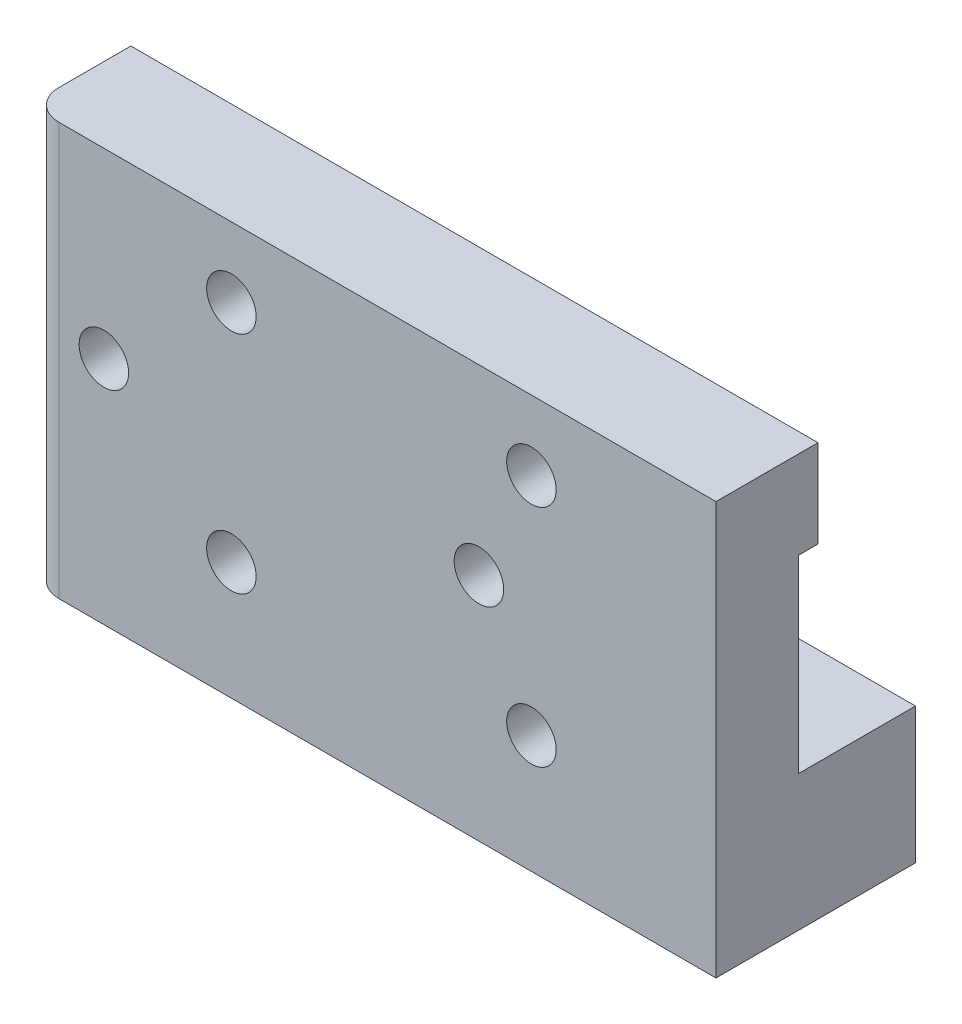
ISO-10303-21;
HEADER;
FILE_DESCRIPTION(('STEP AP214'),'2;1');
FILE_NAME('part.step','',(''),(''),'','','');
FILE_SCHEMA(('AUTOMOTIVE_DESIGN { 1 0 10303 214 1 1 1 1 }'));
ENDSEC;
DATA;
#1=APPLICATION_CONTEXT('core data for automotive mechanical design processes');
#2=APPLICATION_PROTOCOL_DEFINITION('international standard','automotive_design',2000,#1);
#3=PRODUCT_CONTEXT('',#1,'mechanical');
#4=PRODUCT('Part','Part','',(#3));
#5=PRODUCT_RELATED_PRODUCT_CATEGORY('part','',(#4));
#6=PRODUCT_DEFINITION_FORMATION('','',#4);
#7=PRODUCT_DEFINITION_CONTEXT('part definition',#1,'design');
#8=PRODUCT_DEFINITION('design','',#6,#7);
#9=PRODUCT_DEFINITION_SHAPE('','',#8);
#10=(LENGTH_UNIT() NAMED_UNIT(*) SI_UNIT(.MILLI.,.METRE.));
#11=(NAMED_UNIT(*) PLANE_ANGLE_UNIT() SI_UNIT($,.RADIAN.));
#12=(NAMED_UNIT(*) SI_UNIT($,.STERADIAN.) SOLID_ANGLE_UNIT());
#13=UNCERTAINTY_MEASURE_WITH_UNIT(LENGTH_MEASURE(1.E-05),#10,'distance_accuracy_value','');
#14=(GEOMETRIC_REPRESENTATION_CONTEXT(3) GLOBAL_UNCERTAINTY_ASSIGNED_CONTEXT((#13)) GLOBAL_UNIT_ASSIGNED_CONTEXT((#10,
#11,#12)) REPRESENTATION_CONTEXT('',''));
#15=CARTESIAN_POINT('',(0.,0.,0.));
#16=DIRECTION('',(0.,0.,1.));
#17=DIRECTION('',(1.,0.,0.));
#18=AXIS2_PLACEMENT_3D('',#15,#16,#17);
#19=CARTESIAN_POINT('',(0.,0.,1.4));
#20=DIRECTION('',(0.,0.,-1.));
#21=DIRECTION('',(-1.,0.,0.));
#22=AXIS2_PLACEMENT_3D('',#19,#20,#21);
#23=PLANE('',#22);
#24=CARTESIAN_POINT('',(-29.6500000000076,-15.3500000000019,1.4));
#25=DIRECTION('',(0.,0.,1.));
#26=DIRECTION('',(1.,0.,0.));
#27=AXIS2_PLACEMENT_3D('',#24,#25,#26);
#28=CIRCLE('',#27,1.65000000000119);
#29=CARTESIAN_POINT('',(-28.0000000000064,-15.3500000000019,1.4));
#30=VERTEX_POINT('',#29);
#31=EDGE_CURVE('E312',#30,#30,#28,.T.);
#32=ORIENTED_EDGE('',*,*,#31,.T.);
#33=EDGE_LOOP('',(#32));
#34=FACE_BOUND('',#33,.T.);
#35=CARTESIAN_POINT('',(-54.6500000000076,-15.3500000000021,1.4));
#36=DIRECTION('',(0.,0.,1.));
#37=DIRECTION('',(1.,0.,0.));
#38=AXIS2_PLACEMENT_3D('',#35,#36,#37);
#39=CIRCLE('',#38,1.65000000000119);
#40=CARTESIAN_POINT('',(-53.0000000000064,-15.3500000000021,1.4));
#41=VERTEX_POINT('',#40);
#42=EDGE_CURVE('E273',#41,#41,#39,.T.);
#43=ORIENTED_EDGE('',*,*,#42,.T.);
#44=EDGE_LOOP('',(#43));
#45=FACE_BOUND('',#44,.T.);
#46=DIRECTION('',(0.,1.,0.));
#47=VECTOR('',#46,1.);
#48=CARTESIAN_POINT('',(-13.8500000000063,0.,1.4));
#49=LINE('',#48,#47);
#50=CARTESIAN_POINT('',(-13.8500000000063,-21.6499999999996,1.4));
#51=VERTEX_POINT('',#50);
#52=CARTESIAN_POINT('',(-13.8500000000063,-9.04999999999959,1.4));
#53=VERTEX_POINT('',#52);
#54=EDGE_CURVE('E262',#51,#53,#49,.T.);
#55=ORIENTED_EDGE('',*,*,#54,.F.);
#56=DIRECTION('',(1.,0.,0.));
#57=VECTOR('',#56,1.);
#58=CARTESIAN_POINT('',(0.,-21.6499999999996,1.4));
#59=LINE('',#58,#57);
#60=CARTESIAN_POINT('',(-25.0175104948905,-21.6499999999996,1.4));
#61=VERTEX_POINT('',#60);
#62=EDGE_CURVE('E260',#61,#51,#59,.T.);
#63=ORIENTED_EDGE('',*,*,#62,.F.);
#64=CARTESIAN_POINT('',(-26.1500000000038,-22.8499864669215,1.4));
#65=DIRECTION('',(0.,0.,1.));
#66=DIRECTION('',(1.,0.,0.));
#67=AXIS2_PLACEMENT_3D('',#64,#65,#66);
#68=CIRCLE('',#67,1.64999999999618);
#69=CARTESIAN_POINT('',(-27.2824895051171,-21.6499999999996,1.4));
#70=VERTEX_POINT('',#69);
#71=EDGE_CURVE('E246',#61,#70,#68,.T.);
#72=ORIENTED_EDGE('',*,*,#71,.T.);
#73=CARTESIAN_POINT('',(-45.0175104948895,-21.6499999999996,1.4));
#74=VERTEX_POINT('',#73);
#75=EDGE_CURVE('E269',#74,#70,#59,.T.);
#76=ORIENTED_EDGE('',*,*,#75,.F.);
#77=CARTESIAN_POINT('',(-46.1500000000064,-22.8499864669215,1.4));
#78=DIRECTION('',(0.,0.,1.));
#79=DIRECTION('',(1.,0.,0.));
#80=AXIS2_PLACEMENT_3D('',#77,#78,#79);
#81=CIRCLE('',#80,1.64999999999864);
#82=CARTESIAN_POINT('',(-47.2824895051233,-21.6499999999996,1.4));
#83=VERTEX_POINT('',#82);
#84=EDGE_CURVE('E301',#74,#83,#81,.T.);
#85=ORIENTED_EDGE('',*,*,#84,.T.);
#86=CARTESIAN_POINT('',(-59.6500000000061,-21.6499999999996,1.4));
#87=VERTEX_POINT('',#86);
#88=EDGE_CURVE('E267',#87,#83,#59,.T.);
#89=ORIENTED_EDGE('',*,*,#88,.F.);
#90=DIRECTION('',(0.,1.,0.));
#91=VECTOR('',#90,1.);
#92=CARTESIAN_POINT('',(-59.6500000000061,0.,1.4));
#93=LINE('',#92,#91);
#94=CARTESIAN_POINT('',(-59.6500000000061,-9.04999999999959,1.4));
#95=VERTEX_POINT('',#94);
#96=EDGE_CURVE('E318',#87,#95,#93,.T.);
#97=ORIENTED_EDGE('',*,*,#96,.T.);
#98=DIRECTION('',(1.,0.,0.));
#99=VECTOR('',#98,1.);
#100=CARTESIAN_POINT('',(0.,-9.04999999999959,1.4));
#101=LINE('',#100,#99);
#102=CARTESIAN_POINT('',(-47.2824751652994,-9.04999999999959,1.4));
#103=VERTEX_POINT('',#102);
#104=EDGE_CURVE('E337',#95,#103,#101,.T.);
#105=ORIENTED_EDGE('',*,*,#104,.T.);
#106=CARTESIAN_POINT('',(-46.1500000000064,-7.8500000000028,1.4));
#107=DIRECTION('',(0.,0.,1.));
#108=DIRECTION('',(1.,0.,0.));
#109=AXIS2_PLACEMENT_3D('',#106,#107,#108);
#110=CIRCLE('',#109,1.64999999999931);
#111=CARTESIAN_POINT('',(-45.0175248347134,-9.04999999999959,1.4));
#112=VERTEX_POINT('',#111);
#113=EDGE_CURVE('E307',#103,#112,#110,.T.);
#114=ORIENTED_EDGE('',*,*,#113,.T.);
#115=CARTESIAN_POINT('',(-27.2824751652994,-9.04999999999959,1.4));
#116=VERTEX_POINT('',#115);
#117=EDGE_CURVE('E339',#112,#116,#101,.T.);
#118=ORIENTED_EDGE('',*,*,#117,.T.);
#119=CARTESIAN_POINT('',(-26.1500000000064,-7.85000000000278,1.4));
#120=DIRECTION('',(0.,0.,1.));
#121=DIRECTION('',(1.,0.,0.));
#122=AXIS2_PLACEMENT_3D('',#119,#120,#121);
#123=CIRCLE('',#122,1.64999999999932);
#124=CARTESIAN_POINT('',(-25.0175248347134,-9.04999999999959,1.4));
#125=VERTEX_POINT('',#124);
#126=EDGE_CURVE('E296',#116,#125,#123,.T.);
#127=ORIENTED_EDGE('',*,*,#126,.T.);
#128=EDGE_CURVE('E335',#125,#53,#101,.T.);
#129=ORIENTED_EDGE('',*,*,#128,.T.);
#130=EDGE_LOOP('',(#55,#63,#72,#76,#85,#89,#97,#105,#114,#118,#127,#129));
#131=FACE_BOUND('',#130,.T.);
#132=ADVANCED_FACE('F127',(#34,#45,#131),#23,.T.);
#133=CARTESIAN_POINT('',(-26.1500000000064,-7.85000000000278,1.4));
#134=DIRECTION('',(0.,0.,-1.));
#135=DIRECTION('',(-1.,0.,0.));
#136=AXIS2_PLACEMENT_3D('',#133,#134,#135);
#137=CYLINDRICAL_SURFACE('',#136,1.64999999999932);
#138=CARTESIAN_POINT('',(-26.1500000000064,-7.85000000000278,0.1));
#139=DIRECTION('',(0.,0.,1.));
#140=DIRECTION('',(1.,0.,0.));
#141=AXIS2_PLACEMENT_3D('',#138,#139,#140);
#142=CIRCLE('',#141,1.64999999999932);
#143=CARTESIAN_POINT('',(-25.0175248347134,-9.04999999999959,0.1));
#144=VERTEX_POINT('',#143);
#145=CARTESIAN_POINT('',(-27.2824751652994,-9.04999999999959,0.1));
#146=VERTEX_POINT('',#145);
#147=EDGE_CURVE('E334',#144,#146,#142,.T.);
#148=ORIENTED_EDGE('',*,*,#147,.F.);
#149=DIRECTION('',(0.,0.,-1.));
#150=VECTOR('',#149,1.);
#151=CARTESIAN_POINT('',(-25.0175248347134,-9.04999999999959,1.4));
#152=LINE('',#151,#150);
#153=EDGE_CURVE('E372',#125,#144,#152,.T.);
#154=ORIENTED_EDGE('',*,*,#153,.F.);
#155=ORIENTED_EDGE('',*,*,#126,.F.);
#156=DIRECTION('',(0.,0.,-1.));
#157=VECTOR('',#156,1.);
#158=CARTESIAN_POINT('',(-27.2824751652994,-9.04999999999959,1.4));
#159=LINE('',#158,#157);
#160=EDGE_CURVE('E357',#116,#146,#159,.T.);
#161=ORIENTED_EDGE('',*,*,#160,.T.);
#162=EDGE_LOOP('',(#148,#154,#155,#161));
#163=FACE_BOUND('',#162,.T.);
#164=CARTESIAN_POINT('',(-26.1500000000064,-7.85000000000278,6.9));
#165=DIRECTION('',(0.,0.,1.));
#166=DIRECTION('',(1.,0.,0.));
#167=AXIS2_PLACEMENT_3D('',#164,#165,#166);
#168=CIRCLE('',#167,1.64999999999932);
#169=CARTESIAN_POINT('',(-24.500000000007,-7.85000000000278,6.9));
#170=VERTEX_POINT('',#169);
#171=EDGE_CURVE('E298',#170,#170,#168,.T.);
#172=ORIENTED_EDGE('',*,*,#171,.T.);
#173=EDGE_LOOP('',(#172));
#174=FACE_BOUND('',#173,.T.);
#175=ADVANCED_FACE('F406',(#163,#174),#137,.F.);
#176=CARTESIAN_POINT('',(0.,-9.04999999999959,1.4));
#177=DIRECTION('',(0.,1.,0.));
#178=DIRECTION('',(0.,0.,1.));
#179=AXIS2_PLACEMENT_3D('',#176,#177,#178);
#180=PLANE('',#179);
#181=DIRECTION('',(1.,0.,0.));
#182=VECTOR('',#181,1.);
#183=CARTESIAN_POINT('',(0.,-9.04999999999959,0.1));
#184=LINE('',#183,#182);
#185=CARTESIAN_POINT('',(-13.8500000000063,-9.04999999999959,0.1));
#186=VERTEX_POINT('',#185);
#187=EDGE_CURVE('E342',#144,#186,#184,.T.);
#188=ORIENTED_EDGE('',*,*,#187,.T.);
#189=DIRECTION('',(0.,0.,-1.));
#190=VECTOR('',#189,1.);
#191=CARTESIAN_POINT('',(-13.8500000000063,-9.04999999999959,1.4));
#192=LINE('',#191,#190);
#193=EDGE_CURVE('E370',#53,#186,#192,.T.);
#194=ORIENTED_EDGE('',*,*,#193,.F.);
#195=ORIENTED_EDGE('',*,*,#128,.F.);
#196=ORIENTED_EDGE('',*,*,#153,.T.);
#197=EDGE_LOOP('',(#188,#194,#195,#196));
#198=FACE_BOUND('',#197,.T.);
#199=ADVANCED_FACE('F412',(#198),#180,.F.);
#200=CARTESIAN_POINT('',(-13.8500000000063,0.,1.4));
#201=DIRECTION('',(1.,0.,0.));
#202=DIRECTION('',(0.,1.,0.));
#203=AXIS2_PLACEMENT_3D('',#200,#201,#202);
#204=PLANE('',#203);
#205=DIRECTION('',(0.,-1.,0.));
#206=VECTOR('',#205,1.);
#207=CARTESIAN_POINT('',(-13.8500000000063,0.,0.1));
#208=LINE('',#207,#206);
#209=CARTESIAN_POINT('',(-13.8500000000063,-3.20000000000454,0.1));
#210=VERTEX_POINT('',#209);
#211=EDGE_CURVE('E345',#210,#186,#208,.T.);
#212=ORIENTED_EDGE('',*,*,#211,.F.);
#213=DIRECTION('',(0.,0.,-1.));
#214=VECTOR('',#213,1.);
#215=CARTESIAN_POINT('',(-13.8500000000063,-3.20000000000454,1.4));
#216=LINE('',#215,#214);
#217=CARTESIAN_POINT('',(-13.8500000000063,-3.20000000000454,6.9));
#218=VERTEX_POINT('',#217);
#219=EDGE_CURVE('E368',#218,#210,#216,.T.);
#220=ORIENTED_EDGE('',*,*,#219,.F.);
#221=DIRECTION('',(0.,1.,0.));
#222=VECTOR('',#221,1.);
#223=CARTESIAN_POINT('',(-13.8500000000063,0.,6.9));
#224=LINE('',#223,#222);
#225=CARTESIAN_POINT('',(-13.8500000000063,-30.7000000000052,6.9));
#226=VERTEX_POINT('',#225);
#227=EDGE_CURVE('E325',#226,#218,#224,.T.);
#228=ORIENTED_EDGE('',*,*,#227,.F.);
#229=DIRECTION('',(0.,0.,-1.));
#230=VECTOR('',#229,1.);
#231=CARTESIAN_POINT('',(-13.8500000000063,-30.7000000000052,6.9));
#232=LINE('',#231,#230);
#233=CARTESIAN_POINT('',(-13.8500000000063,-30.7000000000052,-6.4));
#234=VERTEX_POINT('',#233);
#235=EDGE_CURVE('E328',#226,#234,#232,.T.);
#236=ORIENTED_EDGE('',*,*,#235,.T.);
#237=DIRECTION('',(0.,1.,0.));
#238=VECTOR('',#237,1.);
#239=CARTESIAN_POINT('',(-13.8500000000063,0.,-6.4));
#240=LINE('',#239,#238);
#241=CARTESIAN_POINT('',(-13.8500000000063,-21.6499999999996,-6.4));
#242=VERTEX_POINT('',#241);
#243=EDGE_CURVE('E281',#234,#242,#240,.T.);
#244=ORIENTED_EDGE('',*,*,#243,.T.);
#245=DIRECTION('',(0.,0.,1.));
#246=VECTOR('',#245,1.);
#247=CARTESIAN_POINT('',(-13.8500000000063,-21.6499999999996,-6.4));
#248=LINE('',#247,#246);
#249=EDGE_CURVE('E274',#242,#51,#248,.T.);
#250=ORIENTED_EDGE('',*,*,#249,.T.);
#251=ORIENTED_EDGE('',*,*,#54,.T.);
#252=ORIENTED_EDGE('',*,*,#193,.T.);
#253=EDGE_LOOP('',(#212,#220,#228,#236,#244,#250,#251,#252));
#254=FACE_BOUND('',#253,.T.);
#255=ADVANCED_FACE('F414',(#254),#204,.T.);
#256=CARTESIAN_POINT('',(0.,-3.20000000000454,1.4));
#257=DIRECTION('',(0.,1.,0.));
#258=DIRECTION('',(0.,0.,1.));
#259=AXIS2_PLACEMENT_3D('',#256,#257,#258);
#260=PLANE('',#259);
#261=DIRECTION('',(0.,0.,-1.));
#262=VECTOR('',#261,1.);
#263=CARTESIAN_POINT('',(-59.6500000000061,-3.20000000000454,1.4));
#264=LINE('',#263,#262);
#265=CARTESIAN_POINT('',(-59.6500000000061,-3.20000000000454,4.9));
#266=VERTEX_POINT('',#265);
#267=CARTESIAN_POINT('',(-59.6500000000061,-3.20000000000454,0.1));
#268=VERTEX_POINT('',#267);
#269=EDGE_CURVE('E366',#266,#268,#264,.T.);
#270=ORIENTED_EDGE('',*,*,#269,.F.);
#271=CARTESIAN_POINT('',(-57.6500000000061,-3.20000000000454,4.9));
#272=DIRECTION('',(0.,1.,0.));
#273=DIRECTION('',(0.,0.,1.));
#274=AXIS2_PLACEMENT_3D('',#271,#272,#273);
#275=CIRCLE('',#274,2.);
#276=CARTESIAN_POINT('',(-57.6500000000061,-3.20000000000454,6.9));
#277=VERTEX_POINT('',#276);
#278=EDGE_CURVE('E149',#266,#277,#275,.T.);
#279=ORIENTED_EDGE('',*,*,#278,.T.);
#280=DIRECTION('',(-1.,0.,0.));
#281=VECTOR('',#280,1.);
#282=CARTESIAN_POINT('',(0.,-3.20000000000454,6.9));
#283=LINE('',#282,#281);
#284=EDGE_CURVE('E321',#218,#277,#283,.T.);
#285=ORIENTED_EDGE('',*,*,#284,.F.);
#286=ORIENTED_EDGE('',*,*,#219,.T.);
#287=DIRECTION('',(1.,0.,0.));
#288=VECTOR('',#287,1.);
#289=CARTESIAN_POINT('',(0.,-3.20000000000454,0.1));
#290=LINE('',#289,#288);
#291=EDGE_CURVE('E349',#268,#210,#290,.T.);
#292=ORIENTED_EDGE('',*,*,#291,.F.);
#293=EDGE_LOOP('',(#270,#279,#285,#286,#292));
#294=FACE_BOUND('',#293,.T.);
#295=ADVANCED_FACE('F386',(#294),#260,.T.);
#296=CARTESIAN_POINT('',(-59.6500000000061,0.,1.4));
#297=DIRECTION('',(1.,0.,0.));
#298=DIRECTION('',(0.,0.,-1.));
#299=AXIS2_PLACEMENT_3D('',#296,#297,#298);
#300=PLANE('',#299);
#301=DIRECTION('',(0.,0.,-1.));
#302=VECTOR('',#301,1.);
#303=CARTESIAN_POINT('',(-59.6500000000061,-30.7000000000052,6.9));
#304=LINE('',#303,#302);
#305=CARTESIAN_POINT('',(-59.6500000000061,-30.7000000000052,4.9));
#306=VERTEX_POINT('',#305);
#307=CARTESIAN_POINT('',(-59.6500000000062,-30.7000000000052,-6.4));
#308=VERTEX_POINT('',#307);
#309=EDGE_CURVE('E332',#306,#308,#304,.T.);
#310=ORIENTED_EDGE('',*,*,#309,.F.);
#311=DIRECTION('',(0.,1.,0.));
#312=VECTOR('',#311,1.);
#313=CARTESIAN_POINT('',(-59.6500000000061,0.,4.9));
#314=LINE('',#313,#312);
#315=EDGE_CURVE('E374',#306,#266,#314,.T.);
#316=ORIENTED_EDGE('',*,*,#315,.T.);
#317=ORIENTED_EDGE('',*,*,#269,.T.);
#318=DIRECTION('',(0.,-1.,0.));
#319=VECTOR('',#318,1.);
#320=CARTESIAN_POINT('',(-59.6500000000061,0.,0.1));
#321=LINE('',#320,#319);
#322=CARTESIAN_POINT('',(-59.6500000000061,-9.04999999999959,0.1));
#323=VERTEX_POINT('',#322);
#324=EDGE_CURVE('E352',#268,#323,#321,.T.);
#325=ORIENTED_EDGE('',*,*,#324,.T.);
#326=DIRECTION('',(0.,0.,-1.));
#327=VECTOR('',#326,1.);
#328=CARTESIAN_POINT('',(-59.6500000000061,-9.04999999999959,1.4));
#329=LINE('',#328,#327);
#330=EDGE_CURVE('E363',#95,#323,#329,.T.);
#331=ORIENTED_EDGE('',*,*,#330,.F.);
#332=ORIENTED_EDGE('',*,*,#96,.F.);
#333=DIRECTION('',(0.,0.,1.));
#334=VECTOR('',#333,1.);
#335=CARTESIAN_POINT('',(-59.6500000000061,-21.6499999999996,-6.4));
#336=LINE('',#335,#334);
#337=CARTESIAN_POINT('',(-59.6500000000061,-21.6499999999996,-6.4));
#338=VERTEX_POINT('',#337);
#339=EDGE_CURVE('E278',#338,#87,#336,.T.);
#340=ORIENTED_EDGE('',*,*,#339,.F.);
#341=DIRECTION('',(0.,1.,0.));
#342=VECTOR('',#341,1.);
#343=CARTESIAN_POINT('',(-59.650000000006,3.65882891816885E-13,-6.4));
#344=LINE('',#343,#342);
#345=EDGE_CURVE('E425',#308,#338,#344,.T.);
#346=ORIENTED_EDGE('',*,*,#345,.F.);
#347=EDGE_LOOP('',(#310,#316,#317,#325,#331,#332,#340,#346));
#348=FACE_BOUND('',#347,.T.);
#349=ADVANCED_FACE('F380',(#348),#300,.F.);
#350=CARTESIAN_POINT('',(-47.2824751652994,-9.04999999999959,0.1));
#351=VERTEX_POINT('',#350);
#352=EDGE_CURVE('E346',#323,#351,#184,.T.);
#353=ORIENTED_EDGE('',*,*,#352,.T.);
#354=DIRECTION('',(0.,0.,-1.));
#355=VECTOR('',#354,1.);
#356=CARTESIAN_POINT('',(-47.2824751652994,-9.04999999999959,1.4));
#357=LINE('',#356,#355);
#358=EDGE_CURVE('E361',#103,#351,#357,.T.);
#359=ORIENTED_EDGE('',*,*,#358,.F.);
#360=ORIENTED_EDGE('',*,*,#104,.F.);
#361=ORIENTED_EDGE('',*,*,#330,.T.);
#362=EDGE_LOOP('',(#353,#359,#360,#361));
#363=FACE_BOUND('',#362,.T.);
#364=ADVANCED_FACE('F397',(#363),#180,.F.);
#365=CARTESIAN_POINT('',(-46.1500000000064,-7.8500000000028,1.4));
#366=DIRECTION('',(0.,0.,-1.));
#367=DIRECTION('',(-1.,0.,0.));
#368=AXIS2_PLACEMENT_3D('',#365,#366,#367);
#369=CYLINDRICAL_SURFACE('',#368,1.64999999999931);
#370=CARTESIAN_POINT('',(-46.1500000000064,-7.8500000000028,0.1));
#371=DIRECTION('',(0.,0.,1.));
#372=DIRECTION('',(1.,0.,0.));
#373=AXIS2_PLACEMENT_3D('',#370,#371,#372);
#374=CIRCLE('',#373,1.64999999999931);
#375=CARTESIAN_POINT('',(-45.0175248347134,-9.04999999999959,0.1));
#376=VERTEX_POINT('',#375);
#377=EDGE_CURVE('E354',#376,#351,#374,.T.);
#378=ORIENTED_EDGE('',*,*,#377,.F.);
#379=DIRECTION('',(0.,0.,-1.));
#380=VECTOR('',#379,1.);
#381=CARTESIAN_POINT('',(-45.0175248347134,-9.04999999999959,1.4));
#382=LINE('',#381,#380);
#383=EDGE_CURVE('E359',#112,#376,#382,.T.);
#384=ORIENTED_EDGE('',*,*,#383,.F.);
#385=ORIENTED_EDGE('',*,*,#113,.F.);
#386=ORIENTED_EDGE('',*,*,#358,.T.);
#387=EDGE_LOOP('',(#378,#384,#385,#386));
#388=FACE_BOUND('',#387,.T.);
#389=CARTESIAN_POINT('',(-46.1500000000064,-7.8500000000028,6.9));
#390=DIRECTION('',(0.,0.,1.));
#391=DIRECTION('',(1.,0.,0.));
#392=AXIS2_PLACEMENT_3D('',#389,#390,#391);
#393=CIRCLE('',#392,1.64999999999931);
#394=CARTESIAN_POINT('',(-44.5000000000071,-7.8500000000028,6.9));
#395=VERTEX_POINT('',#394);
#396=EDGE_CURVE('E309',#395,#395,#393,.T.);
#397=ORIENTED_EDGE('',*,*,#396,.T.);
#398=EDGE_LOOP('',(#397));
#399=FACE_BOUND('',#398,.T.);
#400=ADVANCED_FACE('F476',(#388,#399),#369,.F.);
#401=EDGE_CURVE('E338',#376,#146,#184,.T.);
#402=ORIENTED_EDGE('',*,*,#401,.T.);
#403=ORIENTED_EDGE('',*,*,#160,.F.);
#404=ORIENTED_EDGE('',*,*,#117,.F.);
#405=ORIENTED_EDGE('',*,*,#383,.T.);
#406=EDGE_LOOP('',(#402,#403,#404,#405));
#407=FACE_BOUND('',#406,.T.);
#408=ADVANCED_FACE('F473',(#407),#180,.F.);
#409=CARTESIAN_POINT('',(0.,0.,0.1));
#410=DIRECTION('',(0.,0.,1.));
#411=DIRECTION('',(1.,0.,0.));
#412=AXIS2_PLACEMENT_3D('',#409,#410,#411);
#413=PLANE('',#412);
#414=ORIENTED_EDGE('',*,*,#147,.T.);
#415=ORIENTED_EDGE('',*,*,#401,.F.);
#416=ORIENTED_EDGE('',*,*,#377,.T.);
#417=ORIENTED_EDGE('',*,*,#352,.F.);
#418=ORIENTED_EDGE('',*,*,#324,.F.);
#419=ORIENTED_EDGE('',*,*,#291,.T.);
#420=ORIENTED_EDGE('',*,*,#211,.T.);
#421=ORIENTED_EDGE('',*,*,#187,.F.);
#422=EDGE_LOOP('',(#414,#415,#416,#417,#418,#419,#420,#421));
#423=FACE_BOUND('',#422,.T.);
#424=ADVANCED_FACE('F389',(#423),#413,.F.);
#425=CARTESIAN_POINT('',(0.,0.,6.9));
#426=DIRECTION('',(0.,0.,-1.));
#427=DIRECTION('',(-1.,0.,0.));
#428=AXIS2_PLACEMENT_3D('',#425,#426,#427);
#429=PLANE('',#428);
#430=ORIENTED_EDGE('',*,*,#284,.T.);
#431=DIRECTION('',(0.,1.,0.));
#432=VECTOR('',#431,1.);
#433=CARTESIAN_POINT('',(-57.6500000000061,0.,6.9));
#434=LINE('',#433,#432);
#435=CARTESIAN_POINT('',(-57.6500000000061,-30.7000000000052,6.9));
#436=VERTEX_POINT('',#435);
#437=EDGE_CURVE('E135',#277,#436,#434,.F.);
#438=ORIENTED_EDGE('',*,*,#437,.T.);
#439=DIRECTION('',(-1.,0.,0.));
#440=VECTOR('',#439,1.);
#441=CARTESIAN_POINT('',(0.,-30.7000000000052,6.9));
#442=LINE('',#441,#440);
#443=EDGE_CURVE('E323',#226,#436,#442,.T.);
#444=ORIENTED_EDGE('',*,*,#443,.F.);
#445=ORIENTED_EDGE('',*,*,#227,.T.);
#446=EDGE_LOOP('',(#430,#438,#444,#445));
#447=FACE_BOUND('',#446,.T.);
#448=CARTESIAN_POINT('',(-29.6500000000076,-15.3500000000019,6.9));
#449=DIRECTION('',(0.,0.,1.));
#450=DIRECTION('',(1.,0.,0.));
#451=AXIS2_PLACEMENT_3D('',#448,#449,#450);
#452=CIRCLE('',#451,1.65000000000119);
#453=CARTESIAN_POINT('',(-28.0000000000064,-15.3500000000019,6.9));
#454=VERTEX_POINT('',#453);
#455=EDGE_CURVE('E315',#454,#454,#452,.T.);
#456=ORIENTED_EDGE('',*,*,#455,.F.);
#457=EDGE_LOOP('',(#456));
#458=FACE_BOUND('',#457,.T.);
#459=ORIENTED_EDGE('',*,*,#396,.F.);
#460=EDGE_LOOP('',(#459));
#461=FACE_BOUND('',#460,.T.);
#462=CARTESIAN_POINT('',(-46.1500000000064,-22.8499864669215,6.9));
#463=DIRECTION('',(0.,0.,1.));
#464=DIRECTION('',(1.,0.,0.));
#465=AXIS2_PLACEMENT_3D('',#462,#463,#464);
#466=CIRCLE('',#465,1.64999999999864);
#467=CARTESIAN_POINT('',(-44.5000000000077,-22.8499864669215,6.9));
#468=VERTEX_POINT('',#467);
#469=EDGE_CURVE('E304',#468,#468,#466,.T.);
#470=ORIENTED_EDGE('',*,*,#469,.F.);
#471=EDGE_LOOP('',(#470));
#472=FACE_BOUND('',#471,.T.);
#473=ORIENTED_EDGE('',*,*,#171,.F.);
#474=EDGE_LOOP('',(#473));
#475=FACE_BOUND('',#474,.T.);
#476=CARTESIAN_POINT('',(-26.1500000000038,-22.8499864669215,6.9));
#477=DIRECTION('',(0.,0.,1.));
#478=DIRECTION('',(1.,0.,0.));
#479=AXIS2_PLACEMENT_3D('',#476,#477,#478);
#480=CIRCLE('',#479,1.64999999999618);
#481=CARTESIAN_POINT('',(-24.5000000000076,-22.8499864669215,6.9));
#482=VERTEX_POINT('',#481);
#483=EDGE_CURVE('E256',#482,#482,#480,.T.);
#484=ORIENTED_EDGE('',*,*,#483,.F.);
#485=EDGE_LOOP('',(#484));
#486=FACE_BOUND('',#485,.T.);
#487=CARTESIAN_POINT('',(-54.6500000000076,-15.3500000000021,6.9));
#488=DIRECTION('',(0.,0.,1.));
#489=DIRECTION('',(1.,0.,0.));
#490=AXIS2_PLACEMENT_3D('',#487,#488,#489);
#491=CIRCLE('',#490,1.65000000000119);
#492=CARTESIAN_POINT('',(-53.0000000000064,-15.3500000000021,6.9));
#493=VERTEX_POINT('',#492);
#494=EDGE_CURVE('E257',#493,#493,#491,.T.);
#495=ORIENTED_EDGE('',*,*,#494,.F.);
#496=EDGE_LOOP('',(#495));
#497=FACE_BOUND('',#496,.T.);
#498=ADVANCED_FACE('F465',(#447,#458,#461,#472,#475,#486,#497),#429,.F.);
#499=CARTESIAN_POINT('',(0.,-30.7000000000052,6.9));
#500=DIRECTION('',(0.,-1.,0.));
#501=DIRECTION('',(0.,0.,-1.));
#502=AXIS2_PLACEMENT_3D('',#499,#500,#501);
#503=PLANE('',#502);
#504=ORIENTED_EDGE('',*,*,#443,.T.);
#505=CARTESIAN_POINT('',(-57.6500000000061,-30.7000000000052,4.9));
#506=DIRECTION('',(0.,-1.,0.));
#507=DIRECTION('',(0.,0.,-1.));
#508=AXIS2_PLACEMENT_3D('',#505,#506,#507);
#509=CIRCLE('',#508,2.);
#510=EDGE_CURVE('E12',#436,#306,#509,.T.);
#511=ORIENTED_EDGE('',*,*,#510,.T.);
#512=ORIENTED_EDGE('',*,*,#309,.T.);
#513=DIRECTION('',(1.,0.,0.));
#514=VECTOR('',#513,1.);
#515=CARTESIAN_POINT('',(0.,-30.7000000000052,-6.4));
#516=LINE('',#515,#514);
#517=EDGE_CURVE('E421',#308,#234,#516,.T.);
#518=ORIENTED_EDGE('',*,*,#517,.T.);
#519=ORIENTED_EDGE('',*,*,#235,.F.);
#520=EDGE_LOOP('',(#504,#511,#512,#518,#519));
#521=FACE_BOUND('',#520,.T.);
#522=ADVANCED_FACE('F467',(#521),#503,.T.);
#523=CARTESIAN_POINT('',(-29.6500000000076,-15.3500000000019,6.9));
#524=DIRECTION('',(0.,0.,-1.));
#525=DIRECTION('',(-1.,0.,0.));
#526=AXIS2_PLACEMENT_3D('',#523,#524,#525);
#527=CYLINDRICAL_SURFACE('',#526,1.65000000000119);
#528=ORIENTED_EDGE('',*,*,#455,.T.);
#529=EDGE_LOOP('',(#528));
#530=FACE_BOUND('',#529,.T.);
#531=ORIENTED_EDGE('',*,*,#31,.F.);
#532=EDGE_LOOP('',(#531));
#533=FACE_BOUND('',#532,.T.);
#534=ADVANCED_FACE('F470',(#530,#533),#527,.F.);
#535=CARTESIAN_POINT('',(-46.1500000000064,-22.8499864669215,6.9));
#536=DIRECTION('',(0.,0.,-1.));
#537=DIRECTION('',(-1.,0.,0.));
#538=AXIS2_PLACEMENT_3D('',#535,#536,#537);
#539=CYLINDRICAL_SURFACE('',#538,1.64999999999864);
#540=ORIENTED_EDGE('',*,*,#469,.T.);
#541=EDGE_LOOP('',(#540));
#542=FACE_BOUND('',#541,.T.);
#543=ORIENTED_EDGE('',*,*,#84,.F.);
#544=DIRECTION('',(0.,0.,1.));
#545=VECTOR('',#544,1.);
#546=CARTESIAN_POINT('',(-45.0175104948895,-21.6499999999996,-6.4));
#547=LINE('',#546,#545);
#548=CARTESIAN_POINT('',(-45.0175104948895,-21.6499999999996,-6.4));
#549=VERTEX_POINT('',#548);
#550=EDGE_CURVE('E289',#549,#74,#547,.T.);
#551=ORIENTED_EDGE('',*,*,#550,.F.);
#552=CARTESIAN_POINT('',(-46.1500000000064,-22.8499864669215,-6.4));
#553=DIRECTION('',(0.,0.,1.));
#554=DIRECTION('',(1.,0.,0.));
#555=AXIS2_PLACEMENT_3D('',#552,#553,#554);
#556=CIRCLE('',#555,1.64999999999864);
#557=CARTESIAN_POINT('',(-47.2824895051233,-21.6499999999996,-6.4));
#558=VERTEX_POINT('',#557);
#559=EDGE_CURVE('E429',#558,#549,#556,.T.);
#560=ORIENTED_EDGE('',*,*,#559,.F.);
#561=DIRECTION('',(0.,0.,1.));
#562=VECTOR('',#561,1.);
#563=CARTESIAN_POINT('',(-47.2824895051233,-21.6499999999996,-6.4));
#564=LINE('',#563,#562);
#565=EDGE_CURVE('E286',#558,#83,#564,.T.);
#566=ORIENTED_EDGE('',*,*,#565,.T.);
#567=EDGE_LOOP('',(#543,#551,#560,#566));
#568=FACE_BOUND('',#567,.T.);
#569=ADVANCED_FACE('F444',(#542,#568),#539,.F.);
#570=CARTESIAN_POINT('',(-26.1500000000038,-22.8499864669215,6.9));
#571=DIRECTION('',(0.,0.,-1.));
#572=DIRECTION('',(-1.,0.,0.));
#573=AXIS2_PLACEMENT_3D('',#570,#571,#572);
#574=CYLINDRICAL_SURFACE('',#573,1.64999999999618);
#575=ORIENTED_EDGE('',*,*,#483,.T.);
#576=EDGE_LOOP('',(#575));
#577=FACE_BOUND('',#576,.T.);
#578=ORIENTED_EDGE('',*,*,#71,.F.);
#579=DIRECTION('',(0.,0.,1.));
#580=VECTOR('',#579,1.);
#581=CARTESIAN_POINT('',(-25.0175104948905,-21.6499999999996,-6.4));
#582=LINE('',#581,#580);
#583=CARTESIAN_POINT('',(-25.0175104948905,-21.6499999999996,-6.4));
#584=VERTEX_POINT('',#583);
#585=EDGE_CURVE('E251',#584,#61,#582,.T.);
#586=ORIENTED_EDGE('',*,*,#585,.F.);
#587=CARTESIAN_POINT('',(-26.1500000000038,-22.8499864669215,-6.4));
#588=DIRECTION('',(0.,0.,1.));
#589=DIRECTION('',(1.,0.,0.));
#590=AXIS2_PLACEMENT_3D('',#587,#588,#589);
#591=CIRCLE('',#590,1.64999999999618);
#592=CARTESIAN_POINT('',(-27.2824895051171,-21.6499999999996,-6.4));
#593=VERTEX_POINT('',#592);
#594=EDGE_CURVE('E266',#593,#584,#591,.T.);
#595=ORIENTED_EDGE('',*,*,#594,.F.);
#596=DIRECTION('',(0.,0.,1.));
#597=VECTOR('',#596,1.);
#598=CARTESIAN_POINT('',(-27.2824895051171,-21.6499999999996,-6.4));
#599=LINE('',#598,#597);
#600=EDGE_CURVE('E253',#593,#70,#599,.T.);
#601=ORIENTED_EDGE('',*,*,#600,.T.);
#602=EDGE_LOOP('',(#578,#586,#595,#601));
#603=FACE_BOUND('',#602,.T.);
#604=ADVANCED_FACE('F248',(#577,#603),#574,.F.);
#605=CARTESIAN_POINT('',(-54.6500000000076,-15.3500000000021,6.9));
#606=DIRECTION('',(0.,0.,-1.));
#607=DIRECTION('',(-1.,0.,0.));
#608=AXIS2_PLACEMENT_3D('',#605,#606,#607);
#609=CYLINDRICAL_SURFACE('',#608,1.65000000000119);
#610=ORIENTED_EDGE('',*,*,#494,.T.);
#611=EDGE_LOOP('',(#610));
#612=FACE_BOUND('',#611,.T.);
#613=ORIENTED_EDGE('',*,*,#42,.F.);
#614=EDGE_LOOP('',(#613));
#615=FACE_BOUND('',#614,.T.);
#616=ADVANCED_FACE('F455',(#612,#615),#609,.F.);
#617=CARTESIAN_POINT('',(0.,-21.6499999999996,-6.4));
#618=DIRECTION('',(0.,-1.,0.));
#619=DIRECTION('',(0.,0.,-1.));
#620=AXIS2_PLACEMENT_3D('',#617,#618,#619);
#621=PLANE('',#620);
#622=ORIENTED_EDGE('',*,*,#585,.T.);
#623=ORIENTED_EDGE('',*,*,#62,.T.);
#624=ORIENTED_EDGE('',*,*,#249,.F.);
#625=DIRECTION('',(1.,0.,0.));
#626=VECTOR('',#625,1.);
#627=CARTESIAN_POINT('',(0.,-21.6499999999996,-6.4));
#628=LINE('',#627,#626);
#629=EDGE_CURVE('E271',#584,#242,#628,.T.);
#630=ORIENTED_EDGE('',*,*,#629,.F.);
#631=EDGE_LOOP('',(#622,#623,#624,#630));
#632=FACE_BOUND('',#631,.T.);
#633=ADVANCED_FACE('F270',(#632),#621,.F.);
#634=ORIENTED_EDGE('',*,*,#339,.T.);
#635=ORIENTED_EDGE('',*,*,#88,.T.);
#636=ORIENTED_EDGE('',*,*,#565,.F.);
#637=EDGE_CURVE('E423',#338,#558,#628,.T.);
#638=ORIENTED_EDGE('',*,*,#637,.F.);
#639=EDGE_LOOP('',(#634,#635,#636,#638));
#640=FACE_BOUND('',#639,.T.);
#641=ADVANCED_FACE('F435',(#640),#621,.F.);
#642=ORIENTED_EDGE('',*,*,#550,.T.);
#643=ORIENTED_EDGE('',*,*,#75,.T.);
#644=ORIENTED_EDGE('',*,*,#600,.F.);
#645=EDGE_CURVE('E424',#549,#593,#628,.T.);
#646=ORIENTED_EDGE('',*,*,#645,.F.);
#647=EDGE_LOOP('',(#642,#643,#644,#646));
#648=FACE_BOUND('',#647,.T.);
#649=ADVANCED_FACE('F445',(#648),#621,.F.);
#650=CARTESIAN_POINT('',(0.,0.,-6.4));
#651=DIRECTION('',(0.,0.,1.));
#652=DIRECTION('',(1.,0.,0.));
#653=AXIS2_PLACEMENT_3D('',#650,#651,#652);
#654=PLANE('',#653);
#655=ORIENTED_EDGE('',*,*,#594,.T.);
#656=ORIENTED_EDGE('',*,*,#629,.T.);
#657=ORIENTED_EDGE('',*,*,#243,.F.);
#658=ORIENTED_EDGE('',*,*,#517,.F.);
#659=ORIENTED_EDGE('',*,*,#345,.T.);
#660=ORIENTED_EDGE('',*,*,#637,.T.);
#661=ORIENTED_EDGE('',*,*,#559,.T.);
#662=ORIENTED_EDGE('',*,*,#645,.T.);
#663=EDGE_LOOP('',(#655,#656,#657,#658,#659,#660,#661,#662));
#664=FACE_BOUND('',#663,.T.);
#665=ADVANCED_FACE('F440',(#664),#654,.F.);
#666=CARTESIAN_POINT('',(-57.6500000000061,0.,4.9));
#667=DIRECTION('',(0.,1.,0.));
#668=DIRECTION('',(0.,0.,1.));
#669=AXIS2_PLACEMENT_3D('',#666,#667,#668);
#670=CYLINDRICAL_SURFACE('',#669,2.);
#671=ORIENTED_EDGE('',*,*,#510,.F.);
#672=ORIENTED_EDGE('',*,*,#437,.F.);
#673=ORIENTED_EDGE('',*,*,#278,.F.);
#674=ORIENTED_EDGE('',*,*,#315,.F.);
#675=EDGE_LOOP('',(#671,#672,#673,#674));
#676=FACE_BOUND('',#675,.T.);
#677=ADVANCED_FACE('F129',(#676),#670,.T.);
#678=CLOSED_SHELL('',(#132,#175,#199,#255,#295,#349,#364,#400,#408,#424,#498,#522,#534,#569,
#604,#616,#633,#641,#649,#665,#677));
#679=MANIFOLD_SOLID_BREP('B2',#678);
#680=ADVANCED_BREP_SHAPE_REPRESENTATION('',(#18,#679),#14);
#681=SHAPE_DEFINITION_REPRESENTATION(#9,#680);
ENDSEC;
END-ISO-10303-21;
